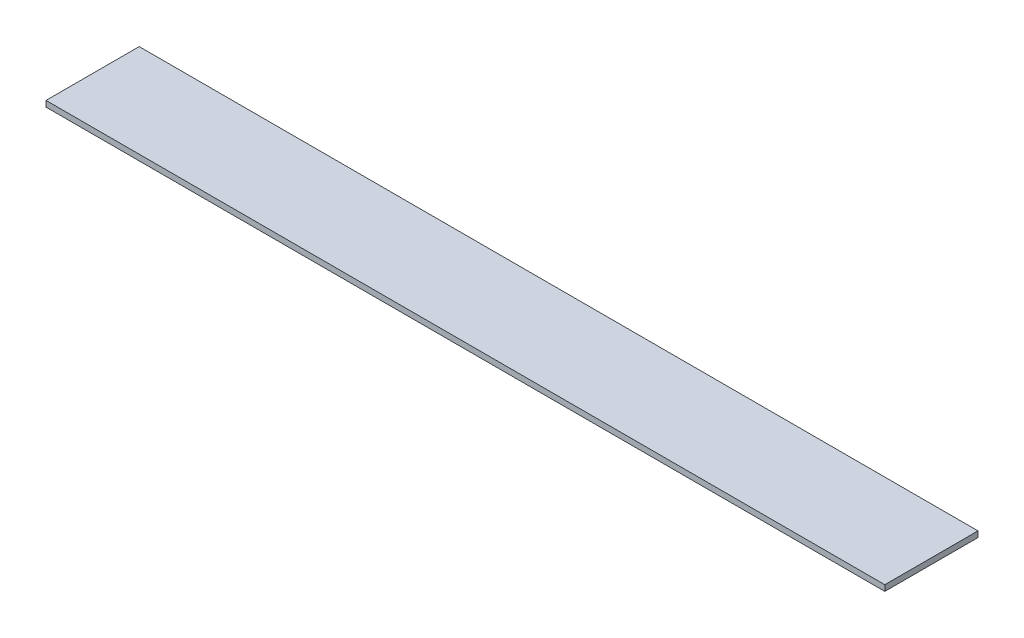
ISO-10303-21;
HEADER;
FILE_DESCRIPTION(('STEP AP214'),'2;1');
FILE_NAME('part.step','',(''),(''),'','','');
FILE_SCHEMA(('AUTOMOTIVE_DESIGN { 1 0 10303 214 1 1 1 1 }'));
ENDSEC;
DATA;
#1=APPLICATION_CONTEXT('core data for automotive mechanical design processes');
#2=APPLICATION_PROTOCOL_DEFINITION('international standard','automotive_design',2000,#1);
#3=PRODUCT_CONTEXT('',#1,'mechanical');
#4=PRODUCT('Part','Part','',(#3));
#5=PRODUCT_RELATED_PRODUCT_CATEGORY('part','',(#4));
#6=PRODUCT_DEFINITION_FORMATION('','',#4);
#7=PRODUCT_DEFINITION_CONTEXT('part definition',#1,'design');
#8=PRODUCT_DEFINITION('design','',#6,#7);
#9=PRODUCT_DEFINITION_SHAPE('','',#8);
#10=(LENGTH_UNIT() NAMED_UNIT(*) SI_UNIT(.MILLI.,.METRE.));
#11=(NAMED_UNIT(*) PLANE_ANGLE_UNIT() SI_UNIT($,.RADIAN.));
#12=(NAMED_UNIT(*) SI_UNIT($,.STERADIAN.) SOLID_ANGLE_UNIT());
#13=UNCERTAINTY_MEASURE_WITH_UNIT(LENGTH_MEASURE(1.E-05),#10,'distance_accuracy_value','');
#14=(GEOMETRIC_REPRESENTATION_CONTEXT(3) GLOBAL_UNCERTAINTY_ASSIGNED_CONTEXT((#13)) GLOBAL_UNIT_ASSIGNED_CONTEXT((#10,
#11,#12)) REPRESENTATION_CONTEXT('',''));
#15=CARTESIAN_POINT('',(0.,0.,0.));
#16=DIRECTION('',(0.,0.,1.));
#17=DIRECTION('',(1.,0.,0.));
#18=AXIS2_PLACEMENT_3D('',#15,#16,#17);
#19=CARTESIAN_POINT('',(0.,1.5875,0.));
#20=DIRECTION('',(1.,0.,0.));
#21=DIRECTION('',(0.,0.,-1.));
#22=AXIS2_PLACEMENT_3D('',#19,#20,#21);
#23=PLANE('',#22);
#24=DIRECTION('',(0.,0.,1.));
#25=VECTOR('',#24,1.);
#26=CARTESIAN_POINT('',(0.,0.,0.));
#27=LINE('',#26,#25);
#28=CARTESIAN_POINT('',(0.,0.,-25.4));
#29=VERTEX_POINT('',#28);
#30=CARTESIAN_POINT('',(0.,0.,0.));
#31=VERTEX_POINT('',#30);
#32=EDGE_CURVE('E97',#29,#31,#27,.T.);
#33=ORIENTED_EDGE('',*,*,#32,.T.);
#34=DIRECTION('',(0.,-1.,0.));
#35=VECTOR('',#34,1.);
#36=CARTESIAN_POINT('',(0.,1.5875,0.));
#37=LINE('',#36,#35);
#38=CARTESIAN_POINT('',(0.,1.5875,0.));
#39=VERTEX_POINT('',#38);
#40=EDGE_CURVE('E11',#39,#31,#37,.T.);
#41=ORIENTED_EDGE('',*,*,#40,.F.);
#42=DIRECTION('',(0.,0.,1.));
#43=VECTOR('',#42,1.);
#44=CARTESIAN_POINT('',(0.,1.5875,0.));
#45=LINE('',#44,#43);
#46=CARTESIAN_POINT('',(0.,1.5875,-25.4));
#47=VERTEX_POINT('',#46);
#48=EDGE_CURVE('E85',#47,#39,#45,.T.);
#49=ORIENTED_EDGE('',*,*,#48,.F.);
#50=DIRECTION('',(0.,-1.,0.));
#51=VECTOR('',#50,1.);
#52=CARTESIAN_POINT('',(0.,1.5875,-25.4));
#53=LINE('',#52,#51);
#54=EDGE_CURVE('E93',#47,#29,#53,.T.);
#55=ORIENTED_EDGE('',*,*,#54,.T.);
#56=EDGE_LOOP('',(#33,#41,#49,#55));
#57=FACE_BOUND('',#56,.T.);
#58=ADVANCED_FACE('F34',(#57),#23,.F.);
#59=CARTESIAN_POINT('',(0.,1.5875,0.));
#60=DIRECTION('',(0.,0.,-1.));
#61=DIRECTION('',(-1.,0.,0.));
#62=AXIS2_PLACEMENT_3D('',#59,#60,#61);
#63=PLANE('',#62);
#64=DIRECTION('',(1.,0.,0.));
#65=VECTOR('',#64,1.);
#66=CARTESIAN_POINT('',(0.,0.,0.));
#67=LINE('',#66,#65);
#68=CARTESIAN_POINT('',(228.6,0.,0.));
#69=VERTEX_POINT('',#68);
#70=EDGE_CURVE('E89',#31,#69,#67,.T.);
#71=ORIENTED_EDGE('',*,*,#70,.T.);
#72=DIRECTION('',(0.,-1.,0.));
#73=VECTOR('',#72,1.);
#74=CARTESIAN_POINT('',(228.6,1.5875,0.));
#75=LINE('',#74,#73);
#76=CARTESIAN_POINT('',(228.6,1.5875,0.));
#77=VERTEX_POINT('',#76);
#78=EDGE_CURVE('E42',#77,#69,#75,.T.);
#79=ORIENTED_EDGE('',*,*,#78,.F.);
#80=DIRECTION('',(1.,0.,0.));
#81=VECTOR('',#80,1.);
#82=CARTESIAN_POINT('',(0.,1.5875,0.));
#83=LINE('',#82,#81);
#84=EDGE_CURVE('E80',#39,#77,#83,.T.);
#85=ORIENTED_EDGE('',*,*,#84,.F.);
#86=ORIENTED_EDGE('',*,*,#40,.T.);
#87=EDGE_LOOP('',(#71,#79,#85,#86));
#88=FACE_BOUND('',#87,.T.);
#89=ADVANCED_FACE('F88',(#88),#63,.F.);
#90=CARTESIAN_POINT('',(228.6,1.5875,0.));
#91=DIRECTION('',(-1.,0.,0.));
#92=DIRECTION('',(0.,0.,1.));
#93=AXIS2_PLACEMENT_3D('',#90,#91,#92);
#94=PLANE('',#93);
#95=DIRECTION('',(0.,0.,-1.));
#96=VECTOR('',#95,1.);
#97=CARTESIAN_POINT('',(228.6,0.,0.));
#98=LINE('',#97,#96);
#99=CARTESIAN_POINT('',(228.6,0.,-25.4));
#100=VERTEX_POINT('',#99);
#101=EDGE_CURVE('E67',#69,#100,#98,.T.);
#102=ORIENTED_EDGE('',*,*,#101,.T.);
#103=DIRECTION('',(0.,-1.,0.));
#104=VECTOR('',#103,1.);
#105=CARTESIAN_POINT('',(228.6,1.5875,-25.4));
#106=LINE('',#105,#104);
#107=CARTESIAN_POINT('',(228.6,1.5875,-25.4));
#108=VERTEX_POINT('',#107);
#109=EDGE_CURVE('E90',#108,#100,#106,.T.);
#110=ORIENTED_EDGE('',*,*,#109,.F.);
#111=DIRECTION('',(0.,0.,-1.));
#112=VECTOR('',#111,1.);
#113=CARTESIAN_POINT('',(228.6,1.5875,0.));
#114=LINE('',#113,#112);
#115=EDGE_CURVE('E83',#77,#108,#114,.T.);
#116=ORIENTED_EDGE('',*,*,#115,.F.);
#117=ORIENTED_EDGE('',*,*,#78,.T.);
#118=EDGE_LOOP('',(#102,#110,#116,#117));
#119=FACE_BOUND('',#118,.T.);
#120=ADVANCED_FACE('F91',(#119),#94,.F.);
#121=CARTESIAN_POINT('',(0.,1.5875,-25.4));
#122=DIRECTION('',(0.,0.,1.));
#123=DIRECTION('',(1.,0.,0.));
#124=AXIS2_PLACEMENT_3D('',#121,#122,#123);
#125=PLANE('',#124);
#126=DIRECTION('',(-1.,0.,0.));
#127=VECTOR('',#126,1.);
#128=CARTESIAN_POINT('',(0.,0.,-25.4));
#129=LINE('',#128,#127);
#130=EDGE_CURVE('E73',#100,#29,#129,.T.);
#131=ORIENTED_EDGE('',*,*,#130,.T.);
#132=ORIENTED_EDGE('',*,*,#54,.F.);
#133=DIRECTION('',(-1.,0.,0.));
#134=VECTOR('',#133,1.);
#135=CARTESIAN_POINT('',(0.,1.5875,-25.4));
#136=LINE('',#135,#134);
#137=EDGE_CURVE('E50',#108,#47,#136,.T.);
#138=ORIENTED_EDGE('',*,*,#137,.F.);
#139=ORIENTED_EDGE('',*,*,#109,.T.);
#140=EDGE_LOOP('',(#131,#132,#138,#139));
#141=FACE_BOUND('',#140,.T.);
#142=ADVANCED_FACE('F104',(#141),#125,.F.);
#143=CARTESIAN_POINT('',(0.,1.5875,0.));
#144=DIRECTION('',(0.,-1.,0.));
#145=DIRECTION('',(0.,0.,-1.));
#146=AXIS2_PLACEMENT_3D('',#143,#144,#145);
#147=PLANE('',#146);
#148=ORIENTED_EDGE('',*,*,#48,.T.);
#149=ORIENTED_EDGE('',*,*,#84,.T.);
#150=ORIENTED_EDGE('',*,*,#115,.T.);
#151=ORIENTED_EDGE('',*,*,#137,.T.);
#152=EDGE_LOOP('',(#148,#149,#150,#151));
#153=FACE_BOUND('',#152,.T.);
#154=ADVANCED_FACE('F81',(#153),#147,.F.);
#155=CARTESIAN_POINT('',(0.,0.,0.));
#156=DIRECTION('',(0.,-1.,0.));
#157=DIRECTION('',(0.,0.,-1.));
#158=AXIS2_PLACEMENT_3D('',#155,#156,#157);
#159=PLANE('',#158);
#160=ORIENTED_EDGE('',*,*,#32,.F.);
#161=ORIENTED_EDGE('',*,*,#130,.F.);
#162=ORIENTED_EDGE('',*,*,#101,.F.);
#163=ORIENTED_EDGE('',*,*,#70,.F.);
#164=EDGE_LOOP('',(#160,#161,#162,#163));
#165=FACE_BOUND('',#164,.T.);
#166=ADVANCED_FACE('F107',(#165),#159,.T.);
#167=CLOSED_SHELL('',(#58,#89,#120,#142,#154,#166));
#168=MANIFOLD_SOLID_BREP('B2',#167);
#169=ADVANCED_BREP_SHAPE_REPRESENTATION('',(#18,#168),#14);
#170=SHAPE_DEFINITION_REPRESENTATION(#9,#169);
ENDSEC;
END-ISO-10303-21;
